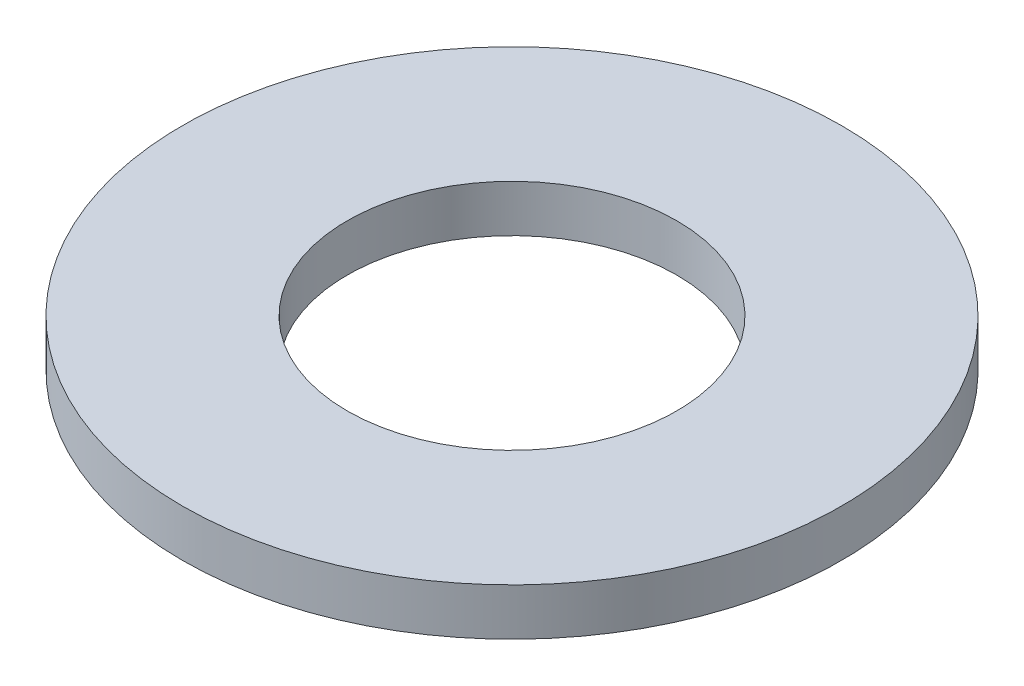
ISO-10303-21;
HEADER;
FILE_DESCRIPTION(('STEP AP214'),'2;1');
FILE_NAME('part.step','',(''),(''),'','','');
FILE_SCHEMA(('AUTOMOTIVE_DESIGN { 1 0 10303 214 1 1 1 1 }'));
ENDSEC;
DATA;
#1=APPLICATION_CONTEXT('core data for automotive mechanical design processes');
#2=APPLICATION_PROTOCOL_DEFINITION('international standard','automotive_design',2000,#1);
#3=PRODUCT_CONTEXT('',#1,'mechanical');
#4=PRODUCT('Part','Part','',(#3));
#5=PRODUCT_RELATED_PRODUCT_CATEGORY('part','',(#4));
#6=PRODUCT_DEFINITION_FORMATION('','',#4);
#7=PRODUCT_DEFINITION_CONTEXT('part definition',#1,'design');
#8=PRODUCT_DEFINITION('design','',#6,#7);
#9=PRODUCT_DEFINITION_SHAPE('','',#8);
#10=(LENGTH_UNIT() NAMED_UNIT(*) SI_UNIT(.MILLI.,.METRE.));
#11=(NAMED_UNIT(*) PLANE_ANGLE_UNIT() SI_UNIT($,.RADIAN.));
#12=(NAMED_UNIT(*) SI_UNIT($,.STERADIAN.) SOLID_ANGLE_UNIT());
#13=UNCERTAINTY_MEASURE_WITH_UNIT(LENGTH_MEASURE(1.E-05),#10,'distance_accuracy_value','');
#14=(GEOMETRIC_REPRESENTATION_CONTEXT(3) GLOBAL_UNCERTAINTY_ASSIGNED_CONTEXT((#13)) GLOBAL_UNIT_ASSIGNED_CONTEXT((#10,
#11,#12)) REPRESENTATION_CONTEXT('',''));
#15=CARTESIAN_POINT('',(0.,0.,0.));
#16=DIRECTION('',(0.,0.,1.));
#17=DIRECTION('',(1.,0.,0.));
#18=AXIS2_PLACEMENT_3D('',#15,#16,#17);
#19=CARTESIAN_POINT('',(0.,0.5,0.));
#20=DIRECTION('',(0.,1.,0.));
#21=DIRECTION('',(0.,0.,1.));
#22=AXIS2_PLACEMENT_3D('',#19,#20,#21);
#23=PLANE('',#22);
#24=CARTESIAN_POINT('',(0.,0.5,0.));
#25=DIRECTION('',(0.,1.,0.));
#26=DIRECTION('',(0.,0.,1.));
#27=AXIS2_PLACEMENT_3D('',#24,#25,#26);
#28=CIRCLE('',#27,3.5);
#29=CARTESIAN_POINT('',(0.,0.5,3.5));
#30=VERTEX_POINT('',#29);
#31=EDGE_CURVE('E10',#30,#30,#28,.T.);
#32=ORIENTED_EDGE('',*,*,#31,.T.);
#33=EDGE_LOOP('',(#32));
#34=FACE_BOUND('',#33,.T.);
#35=CARTESIAN_POINT('',(0.,0.5,0.));
#36=DIRECTION('',(0.,1.,0.));
#37=DIRECTION('',(0.,0.,1.));
#38=AXIS2_PLACEMENT_3D('',#35,#36,#37);
#39=CIRCLE('',#38,1.75);
#40=CARTESIAN_POINT('',(0.,0.5,1.75));
#41=VERTEX_POINT('',#40);
#42=EDGE_CURVE('E45',#41,#41,#39,.T.);
#43=ORIENTED_EDGE('',*,*,#42,.F.);
#44=EDGE_LOOP('',(#43));
#45=FACE_BOUND('',#44,.T.);
#46=ADVANCED_FACE('F34',(#34,#45),#23,.T.);
#47=CARTESIAN_POINT('',(0.,0.,0.));
#48=DIRECTION('',(0.,1.,0.));
#49=DIRECTION('',(0.,0.,1.));
#50=AXIS2_PLACEMENT_3D('',#47,#48,#49);
#51=PLANE('',#50);
#52=CARTESIAN_POINT('',(0.,0.,0.));
#53=DIRECTION('',(0.,1.,0.));
#54=DIRECTION('',(0.,0.,1.));
#55=AXIS2_PLACEMENT_3D('',#52,#53,#54);
#56=CIRCLE('',#55,3.5);
#57=CARTESIAN_POINT('',(0.,0.,3.5));
#58=VERTEX_POINT('',#57);
#59=EDGE_CURVE('E38',#58,#58,#56,.T.);
#60=ORIENTED_EDGE('',*,*,#59,.F.);
#61=EDGE_LOOP('',(#60));
#62=FACE_BOUND('',#61,.T.);
#63=CARTESIAN_POINT('',(0.,0.,0.));
#64=DIRECTION('',(0.,1.,0.));
#65=DIRECTION('',(0.,0.,1.));
#66=AXIS2_PLACEMENT_3D('',#63,#64,#65);
#67=CIRCLE('',#66,1.75);
#68=CARTESIAN_POINT('',(0.,0.,1.75));
#69=VERTEX_POINT('',#68);
#70=EDGE_CURVE('E47',#69,#69,#67,.T.);
#71=ORIENTED_EDGE('',*,*,#70,.T.);
#72=EDGE_LOOP('',(#71));
#73=FACE_BOUND('',#72,.T.);
#74=ADVANCED_FACE('F57',(#62,#73),#51,.F.);
#75=CARTESIAN_POINT('',(0.,0.5,0.));
#76=DIRECTION('',(0.,-1.,0.));
#77=DIRECTION('',(0.,0.,-1.));
#78=AXIS2_PLACEMENT_3D('',#75,#76,#77);
#79=CYLINDRICAL_SURFACE('',#78,3.5);
#80=ORIENTED_EDGE('',*,*,#31,.F.);
#81=EDGE_LOOP('',(#80));
#82=FACE_BOUND('',#81,.T.);
#83=ORIENTED_EDGE('',*,*,#59,.T.);
#84=EDGE_LOOP('',(#83));
#85=FACE_BOUND('',#84,.T.);
#86=ADVANCED_FACE('F36',(#82,#85),#79,.T.);
#87=CARTESIAN_POINT('',(0.,0.5,0.));
#88=DIRECTION('',(0.,-1.,0.));
#89=DIRECTION('',(0.,0.,-1.));
#90=AXIS2_PLACEMENT_3D('',#87,#88,#89);
#91=CYLINDRICAL_SURFACE('',#90,1.75);
#92=ORIENTED_EDGE('',*,*,#42,.T.);
#93=EDGE_LOOP('',(#92));
#94=FACE_BOUND('',#93,.T.);
#95=ORIENTED_EDGE('',*,*,#70,.F.);
#96=EDGE_LOOP('',(#95));
#97=FACE_BOUND('',#96,.T.);
#98=ADVANCED_FACE('F53',(#94,#97),#91,.F.);
#99=CLOSED_SHELL('',(#46,#74,#86,#98));
#100=MANIFOLD_SOLID_BREP('B2',#99);
#101=ADVANCED_BREP_SHAPE_REPRESENTATION('',(#18,#100),#14);
#102=SHAPE_DEFINITION_REPRESENTATION(#9,#101);
ENDSEC;
END-ISO-10303-21;
